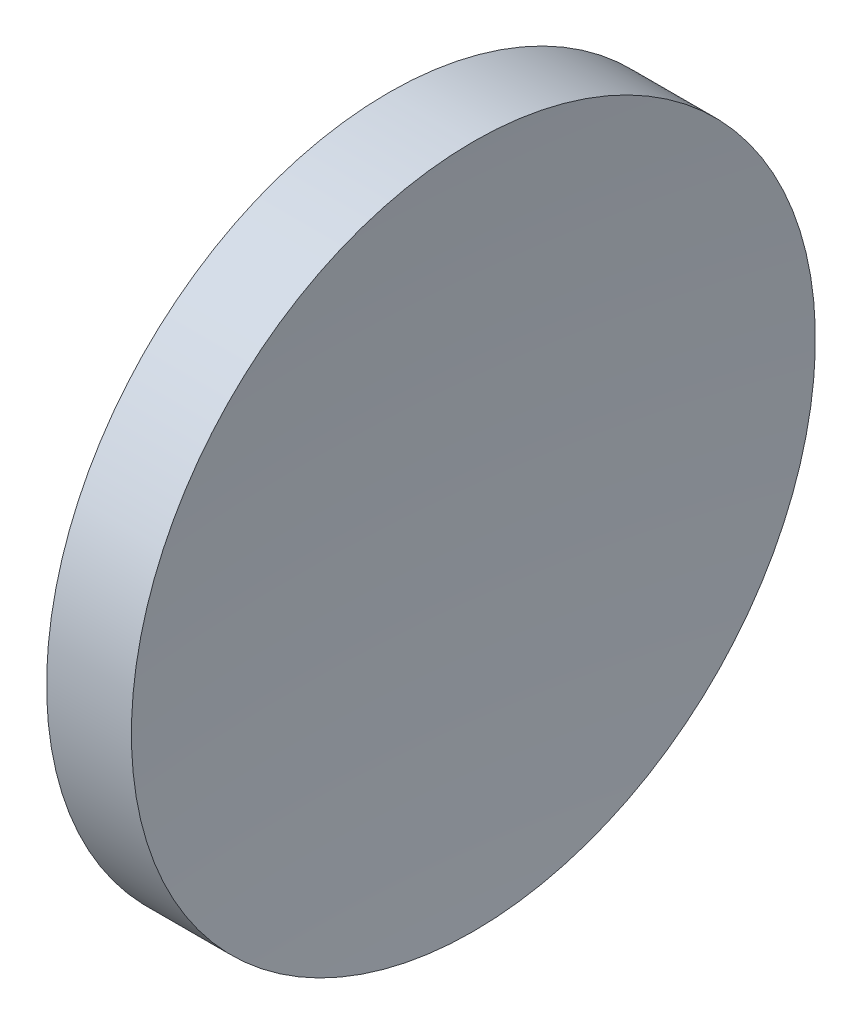
ISO-10303-21;
HEADER;
FILE_DESCRIPTION(('STEP AP214'),'2;1');
FILE_NAME('part.step','',(''),(''),'','','');
FILE_SCHEMA(('AUTOMOTIVE_DESIGN { 1 0 10303 214 1 1 1 1 }'));
ENDSEC;
DATA;
#1=APPLICATION_CONTEXT('core data for automotive mechanical design processes');
#2=APPLICATION_PROTOCOL_DEFINITION('international standard','automotive_design',2000,#1);
#3=PRODUCT_CONTEXT('',#1,'mechanical');
#4=PRODUCT('Part','Part','',(#3));
#5=PRODUCT_RELATED_PRODUCT_CATEGORY('part','',(#4));
#6=PRODUCT_DEFINITION_FORMATION('','',#4);
#7=PRODUCT_DEFINITION_CONTEXT('part definition',#1,'design');
#8=PRODUCT_DEFINITION('design','',#6,#7);
#9=PRODUCT_DEFINITION_SHAPE('','',#8);
#10=(LENGTH_UNIT() NAMED_UNIT(*) SI_UNIT(.MILLI.,.METRE.));
#11=(NAMED_UNIT(*) PLANE_ANGLE_UNIT() SI_UNIT($,.RADIAN.));
#12=(NAMED_UNIT(*) SI_UNIT($,.STERADIAN.) SOLID_ANGLE_UNIT());
#13=UNCERTAINTY_MEASURE_WITH_UNIT(LENGTH_MEASURE(1.E-05),#10,'distance_accuracy_value','');
#14=(GEOMETRIC_REPRESENTATION_CONTEXT(3) GLOBAL_UNCERTAINTY_ASSIGNED_CONTEXT((#13)) GLOBAL_UNIT_ASSIGNED_CONTEXT((#10,
#11,#12)) REPRESENTATION_CONTEXT('',''));
#15=CARTESIAN_POINT('',(0.,0.,0.));
#16=DIRECTION('',(0.,0.,1.));
#17=DIRECTION('',(1.,0.,0.));
#18=AXIS2_PLACEMENT_3D('',#15,#16,#17);
#19=CARTESIAN_POINT('',(237.89044396836,52.1780822983935,0.));
#20=DIRECTION('',(-1.,0.,0.));
#21=DIRECTION('',(0.,-1.,0.));
#22=AXIS2_PLACEMENT_3D('',#19,#20,#21);
#23=SPHERICAL_SURFACE('',#22,140.8);
#24=CARTESIAN_POINT('',(97.6643764915884,52.1780822983899,0.));
#25=DIRECTION('',(-1.,0.,0.));
#26=DIRECTION('',(0.,-1.,0.));
#27=AXIS2_PLACEMENT_3D('',#24,#25,#26);
#28=CIRCLE('',#27,12.7);
#29=CARTESIAN_POINT('',(97.6643764915884,39.4780822983899,0.));
#30=VERTEX_POINT('',#29);
#31=EDGE_CURVE('E10',#30,#30,#28,.T.);
#32=ORIENTED_EDGE('',*,*,#31,.F.);
#33=EDGE_LOOP('',(#32));
#34=FACE_BOUND('',#33,.T.);
#35=ADVANCED_FACE('F35',(#34),#23,.F.);
#36=CARTESIAN_POINT('',(89.8586564536171,52.1780822983899,0.));
#37=DIRECTION('',(-1.,0.,0.));
#38=DIRECTION('',(0.,-1.,0.));
#39=AXIS2_PLACEMENT_3D('',#36,#37,#38);
#40=CYLINDRICAL_SURFACE('',#39,12.7);
#41=CARTESIAN_POINT('',(94.5165114451312,52.1780822983899,0.));
#42=DIRECTION('',(-1.,0.,0.));
#43=DIRECTION('',(0.,-1.,0.));
#44=AXIS2_PLACEMENT_3D('',#41,#42,#43);
#45=CIRCLE('',#44,12.7);
#46=CARTESIAN_POINT('',(94.5165114451312,39.4780822983899,0.));
#47=VERTEX_POINT('',#46);
#48=EDGE_CURVE('E41',#47,#47,#45,.T.);
#49=ORIENTED_EDGE('',*,*,#48,.F.);
#50=EDGE_LOOP('',(#49));
#51=FACE_BOUND('',#50,.T.);
#52=ORIENTED_EDGE('',*,*,#31,.T.);
#53=EDGE_LOOP('',(#52));
#54=FACE_BOUND('',#53,.T.);
#55=ADVANCED_FACE('F49',(#51,#54),#40,.T.);
#56=CARTESIAN_POINT('',(-45.70955603164,52.1780822983899,0.));
#57=DIRECTION('',(-1.,0.,0.));
#58=DIRECTION('',(0.,1.,0.));
#59=AXIS2_PLACEMENT_3D('',#56,#57,#58);
#60=SPHERICAL_SURFACE('',#59,140.8);
#61=ORIENTED_EDGE('',*,*,#48,.T.);
#62=EDGE_LOOP('',(#61));
#63=FACE_BOUND('',#62,.T.);
#64=ADVANCED_FACE('F47',(#63),#60,.F.);
#65=CLOSED_SHELL('',(#35,#55,#64));
#66=MANIFOLD_SOLID_BREP('B2',#65);
#67=ADVANCED_BREP_SHAPE_REPRESENTATION('',(#18,#66),#14);
#68=SHAPE_DEFINITION_REPRESENTATION(#9,#67);
ENDSEC;
END-ISO-10303-21;
